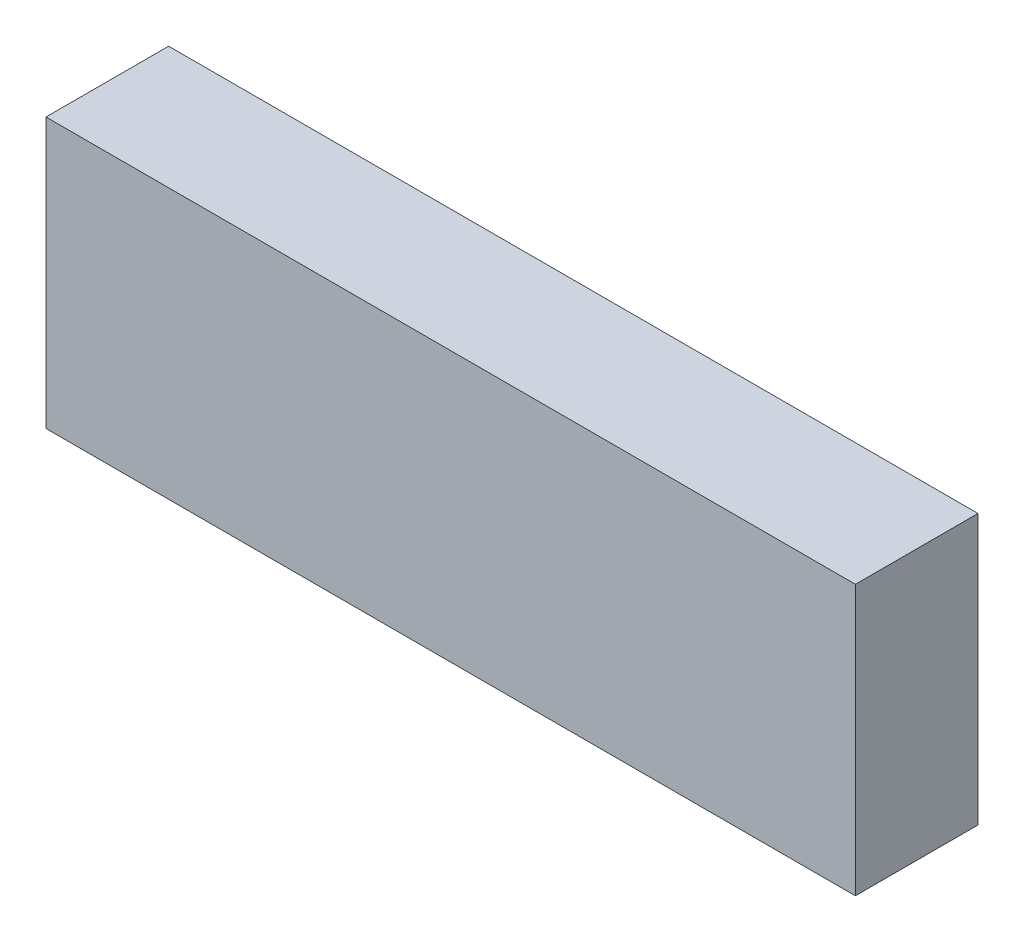
ISO-10303-21;
HEADER;
FILE_DESCRIPTION(('STEP AP214'),'2;1');
FILE_NAME('part.step','',(''),(''),'','','');
FILE_SCHEMA(('AUTOMOTIVE_DESIGN { 1 0 10303 214 1 1 1 1 }'));
ENDSEC;
DATA;
#1=APPLICATION_CONTEXT('core data for automotive mechanical design processes');
#2=APPLICATION_PROTOCOL_DEFINITION('international standard','automotive_design',2000,#1);
#3=PRODUCT_CONTEXT('',#1,'mechanical');
#4=PRODUCT('Part','Part','',(#3));
#5=PRODUCT_RELATED_PRODUCT_CATEGORY('part','',(#4));
#6=PRODUCT_DEFINITION_FORMATION('','',#4);
#7=PRODUCT_DEFINITION_CONTEXT('part definition',#1,'design');
#8=PRODUCT_DEFINITION('design','',#6,#7);
#9=PRODUCT_DEFINITION_SHAPE('','',#8);
#10=(LENGTH_UNIT() NAMED_UNIT(*) SI_UNIT(.MILLI.,.METRE.));
#11=(NAMED_UNIT(*) PLANE_ANGLE_UNIT() SI_UNIT($,.RADIAN.));
#12=(NAMED_UNIT(*) SI_UNIT($,.STERADIAN.) SOLID_ANGLE_UNIT());
#13=UNCERTAINTY_MEASURE_WITH_UNIT(LENGTH_MEASURE(1.E-05),#10,'distance_accuracy_value','');
#14=(GEOMETRIC_REPRESENTATION_CONTEXT(3) GLOBAL_UNCERTAINTY_ASSIGNED_CONTEXT((#13)) GLOBAL_UNIT_ASSIGNED_CONTEXT((#10,
#11,#12)) REPRESENTATION_CONTEXT('',''));
#15=CARTESIAN_POINT('',(0.,0.,0.));
#16=DIRECTION('',(0.,0.,1.));
#17=DIRECTION('',(1.,0.,0.));
#18=AXIS2_PLACEMENT_3D('',#15,#16,#17);
#19=CARTESIAN_POINT('',(0.8382,-0.2794,0.254));
#20=DIRECTION('',(0.,0.,-1.));
#21=DIRECTION('',(-1.,0.,0.));
#22=AXIS2_PLACEMENT_3D('',#19,#20,#21);
#23=PLANE('',#22);
#24=DIRECTION('',(1.,0.,0.));
#25=VECTOR('',#24,1.);
#26=CARTESIAN_POINT('',(0.8382,0.2794,0.254));
#27=LINE('',#26,#25);
#28=CARTESIAN_POINT('',(0.8382,0.2794,0.254));
#29=VERTEX_POINT('',#28);
#30=CARTESIAN_POINT('',(-0.8382,0.2794,0.254));
#31=VERTEX_POINT('',#30);
#32=EDGE_CURVE('E55',#29,#31,#27,.F.);
#33=ORIENTED_EDGE('',*,*,#32,.T.);
#34=DIRECTION('',(0.,1.,0.));
#35=VECTOR('',#34,1.);
#36=CARTESIAN_POINT('',(-0.8382,0.2794,0.254));
#37=LINE('',#36,#35);
#38=CARTESIAN_POINT('',(-0.8382,-0.2794,0.254));
#39=VERTEX_POINT('',#38);
#40=EDGE_CURVE('E58',#31,#39,#37,.F.);
#41=ORIENTED_EDGE('',*,*,#40,.T.);
#42=DIRECTION('',(1.,0.,0.));
#43=VECTOR('',#42,1.);
#44=CARTESIAN_POINT('',(-0.8382,-0.2794,0.254));
#45=LINE('',#44,#43);
#46=CARTESIAN_POINT('',(0.8382,-0.2794,0.254));
#47=VERTEX_POINT('',#46);
#48=EDGE_CURVE('E60',#39,#47,#45,.T.);
#49=ORIENTED_EDGE('',*,*,#48,.T.);
#50=DIRECTION('',(0.,1.,0.));
#51=VECTOR('',#50,1.);
#52=CARTESIAN_POINT('',(0.8382,-0.2794,0.254));
#53=LINE('',#52,#51);
#54=EDGE_CURVE('E20',#29,#47,#53,.F.);
#55=ORIENTED_EDGE('',*,*,#54,.F.);
#56=EDGE_LOOP('',(#33,#41,#49,#55));
#57=FACE_BOUND('',#56,.T.);
#58=ADVANCED_FACE('F17',(#57),#23,.F.);
#59=CARTESIAN_POINT('',(-0.8382,-0.2794,0.));
#60=DIRECTION('',(0.,1.,0.));
#61=DIRECTION('',(0.,0.,1.));
#62=AXIS2_PLACEMENT_3D('',#59,#60,#61);
#63=PLANE('',#62);
#64=DIRECTION('',(0.,0.,1.));
#65=VECTOR('',#64,1.);
#66=CARTESIAN_POINT('',(0.8382,-0.2794,0.));
#67=LINE('',#66,#65);
#68=CARTESIAN_POINT('',(0.8382,-0.2794,0.));
#69=VERTEX_POINT('',#68);
#70=EDGE_CURVE('E71',#69,#47,#67,.T.);
#71=ORIENTED_EDGE('',*,*,#70,.T.);
#72=ORIENTED_EDGE('',*,*,#48,.F.);
#73=DIRECTION('',(0.,0.,-1.));
#74=VECTOR('',#73,1.);
#75=CARTESIAN_POINT('',(-0.8382,-0.2794,0.));
#76=LINE('',#75,#74);
#77=CARTESIAN_POINT('',(-0.8382,-0.2794,0.));
#78=VERTEX_POINT('',#77);
#79=EDGE_CURVE('E65',#39,#78,#76,.T.);
#80=ORIENTED_EDGE('',*,*,#79,.T.);
#81=DIRECTION('',(-1.,0.,0.));
#82=VECTOR('',#81,1.);
#83=CARTESIAN_POINT('',(0.8382,-0.2794,0.));
#84=LINE('',#83,#82);
#85=EDGE_CURVE('E83',#69,#78,#84,.T.);
#86=ORIENTED_EDGE('',*,*,#85,.F.);
#87=EDGE_LOOP('',(#71,#72,#80,#86));
#88=FACE_BOUND('',#87,.T.);
#89=ADVANCED_FACE('F68',(#88),#63,.F.);
#90=CARTESIAN_POINT('',(-0.8382,0.2794,0.));
#91=DIRECTION('',(1.,0.,0.));
#92=DIRECTION('',(0.,0.,-1.));
#93=AXIS2_PLACEMENT_3D('',#90,#91,#92);
#94=PLANE('',#93);
#95=ORIENTED_EDGE('',*,*,#79,.F.);
#96=ORIENTED_EDGE('',*,*,#40,.F.);
#97=DIRECTION('',(0.,0.,-1.));
#98=VECTOR('',#97,1.);
#99=CARTESIAN_POINT('',(-0.8382,0.2794,0.));
#100=LINE('',#99,#98);
#101=CARTESIAN_POINT('',(-0.8382,0.2794,0.));
#102=VERTEX_POINT('',#101);
#103=EDGE_CURVE('E77',#31,#102,#100,.T.);
#104=ORIENTED_EDGE('',*,*,#103,.T.);
#105=DIRECTION('',(0.,1.,0.));
#106=VECTOR('',#105,1.);
#107=CARTESIAN_POINT('',(-0.8382,-0.2794,0.));
#108=LINE('',#107,#106);
#109=EDGE_CURVE('E74',#78,#102,#108,.T.);
#110=ORIENTED_EDGE('',*,*,#109,.F.);
#111=EDGE_LOOP('',(#95,#96,#104,#110));
#112=FACE_BOUND('',#111,.T.);
#113=ADVANCED_FACE('F72',(#112),#94,.F.);
#114=CARTESIAN_POINT('',(0.8382,0.2794,0.));
#115=DIRECTION('',(0.,-1.,0.));
#116=DIRECTION('',(0.,0.,-1.));
#117=AXIS2_PLACEMENT_3D('',#114,#115,#116);
#118=PLANE('',#117);
#119=ORIENTED_EDGE('',*,*,#103,.F.);
#120=ORIENTED_EDGE('',*,*,#32,.F.);
#121=DIRECTION('',(0.,0.,1.));
#122=VECTOR('',#121,1.);
#123=CARTESIAN_POINT('',(0.8382,0.2794,0.));
#124=LINE('',#123,#122);
#125=CARTESIAN_POINT('',(0.8382,0.2794,0.));
#126=VERTEX_POINT('',#125);
#127=EDGE_CURVE('E35',#29,#126,#124,.F.);
#128=ORIENTED_EDGE('',*,*,#127,.T.);
#129=DIRECTION('',(-1.,0.,0.));
#130=VECTOR('',#129,1.);
#131=CARTESIAN_POINT('',(0.8382,0.2794,0.));
#132=LINE('',#131,#130);
#133=EDGE_CURVE('E26',#102,#126,#132,.F.);
#134=ORIENTED_EDGE('',*,*,#133,.F.);
#135=EDGE_LOOP('',(#119,#120,#128,#134));
#136=FACE_BOUND('',#135,.T.);
#137=ADVANCED_FACE('F89',(#136),#118,.F.);
#138=CARTESIAN_POINT('',(0.8382,-0.2794,0.));
#139=DIRECTION('',(-1.,0.,0.));
#140=DIRECTION('',(0.,0.,1.));
#141=AXIS2_PLACEMENT_3D('',#138,#139,#140);
#142=PLANE('',#141);
#143=ORIENTED_EDGE('',*,*,#127,.F.);
#144=ORIENTED_EDGE('',*,*,#54,.T.);
#145=ORIENTED_EDGE('',*,*,#70,.F.);
#146=DIRECTION('',(0.,1.,0.));
#147=VECTOR('',#146,1.);
#148=CARTESIAN_POINT('',(0.8382,-0.2794,0.));
#149=LINE('',#148,#147);
#150=EDGE_CURVE('E11',#126,#69,#149,.F.);
#151=ORIENTED_EDGE('',*,*,#150,.F.);
#152=EDGE_LOOP('',(#143,#144,#145,#151));
#153=FACE_BOUND('',#152,.T.);
#154=ADVANCED_FACE('F91',(#153),#142,.F.);
#155=CARTESIAN_POINT('',(0.8382,-0.2794,0.));
#156=DIRECTION('',(0.,0.,-1.));
#157=DIRECTION('',(-1.,0.,0.));
#158=AXIS2_PLACEMENT_3D('',#155,#156,#157);
#159=PLANE('',#158);
#160=ORIENTED_EDGE('',*,*,#133,.T.);
#161=ORIENTED_EDGE('',*,*,#150,.T.);
#162=ORIENTED_EDGE('',*,*,#85,.T.);
#163=ORIENTED_EDGE('',*,*,#109,.T.);
#164=EDGE_LOOP('',(#160,#161,#162,#163));
#165=FACE_BOUND('',#164,.T.);
#166=ADVANCED_FACE('F88',(#165),#159,.T.);
#167=CLOSED_SHELL('',(#58,#89,#113,#137,#154,#166));
#168=MANIFOLD_SOLID_BREP('B1',#167);
#169=ADVANCED_BREP_SHAPE_REPRESENTATION('',(#18,#168),#14);
#170=SHAPE_DEFINITION_REPRESENTATION(#9,#169);
ENDSEC;
END-ISO-10303-21;
